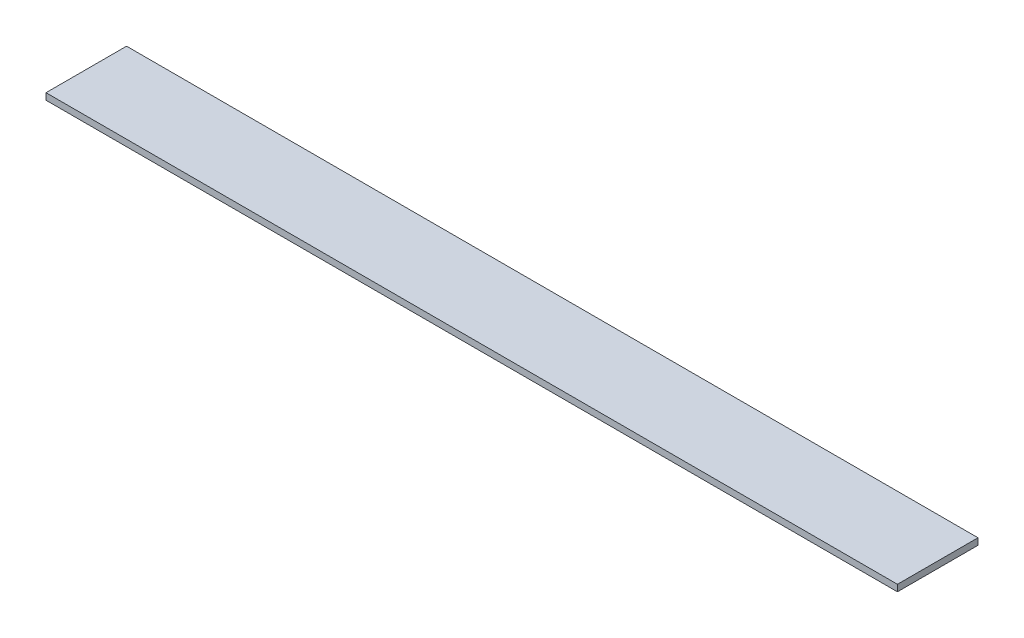
ISO-10303-21;
HEADER;
FILE_DESCRIPTION(('STEP AP214'),'2;1');
FILE_NAME('part.step','',(''),(''),'','','');
FILE_SCHEMA(('AUTOMOTIVE_DESIGN { 1 0 10303 214 1 1 1 1 }'));
ENDSEC;
DATA;
#1=APPLICATION_CONTEXT('core data for automotive mechanical design processes');
#2=APPLICATION_PROTOCOL_DEFINITION('international standard','automotive_design',2000,#1);
#3=PRODUCT_CONTEXT('',#1,'mechanical');
#4=PRODUCT('Part','Part','',(#3));
#5=PRODUCT_RELATED_PRODUCT_CATEGORY('part','',(#4));
#6=PRODUCT_DEFINITION_FORMATION('','',#4);
#7=PRODUCT_DEFINITION_CONTEXT('part definition',#1,'design');
#8=PRODUCT_DEFINITION('design','',#6,#7);
#9=PRODUCT_DEFINITION_SHAPE('','',#8);
#10=(LENGTH_UNIT() NAMED_UNIT(*) SI_UNIT(.MILLI.,.METRE.));
#11=(NAMED_UNIT(*) PLANE_ANGLE_UNIT() SI_UNIT($,.RADIAN.));
#12=(NAMED_UNIT(*) SI_UNIT($,.STERADIAN.) SOLID_ANGLE_UNIT());
#13=UNCERTAINTY_MEASURE_WITH_UNIT(LENGTH_MEASURE(1.E-05),#10,'distance_accuracy_value','');
#14=(GEOMETRIC_REPRESENTATION_CONTEXT(3) GLOBAL_UNCERTAINTY_ASSIGNED_CONTEXT((#13)) GLOBAL_UNIT_ASSIGNED_CONTEXT((#10,
#11,#12)) REPRESENTATION_CONTEXT('',''));
#15=CARTESIAN_POINT('',(0.,0.,0.));
#16=DIRECTION('',(0.,0.,1.));
#17=DIRECTION('',(1.,0.,0.));
#18=AXIS2_PLACEMENT_3D('',#15,#16,#17);
#19=CARTESIAN_POINT('',(0.,1.,0.));
#20=DIRECTION('',(1.,0.,0.));
#21=DIRECTION('',(0.,0.,-1.));
#22=AXIS2_PLACEMENT_3D('',#19,#20,#21);
#23=PLANE('',#22);
#24=DIRECTION('',(0.,0.,1.));
#25=VECTOR('',#24,1.);
#26=CARTESIAN_POINT('',(0.,0.,0.));
#27=LINE('',#26,#25);
#28=CARTESIAN_POINT('',(0.,0.,-12.3));
#29=VERTEX_POINT('',#28);
#30=CARTESIAN_POINT('',(0.,0.,0.));
#31=VERTEX_POINT('',#30);
#32=EDGE_CURVE('E95',#29,#31,#27,.T.);
#33=ORIENTED_EDGE('',*,*,#32,.T.);
#34=DIRECTION('',(0.,-1.,0.));
#35=VECTOR('',#34,1.);
#36=CARTESIAN_POINT('',(0.,1.,0.));
#37=LINE('',#36,#35);
#38=CARTESIAN_POINT('',(0.,1.,0.));
#39=VERTEX_POINT('',#38);
#40=EDGE_CURVE('E11',#39,#31,#37,.T.);
#41=ORIENTED_EDGE('',*,*,#40,.F.);
#42=DIRECTION('',(0.,0.,1.));
#43=VECTOR('',#42,1.);
#44=CARTESIAN_POINT('',(0.,1.,0.));
#45=LINE('',#44,#43);
#46=CARTESIAN_POINT('',(0.,1.,-12.3));
#47=VERTEX_POINT('',#46);
#48=EDGE_CURVE('E83',#47,#39,#45,.T.);
#49=ORIENTED_EDGE('',*,*,#48,.F.);
#50=DIRECTION('',(0.,-1.,0.));
#51=VECTOR('',#50,1.);
#52=CARTESIAN_POINT('',(0.,1.,-12.3));
#53=LINE('',#52,#51);
#54=EDGE_CURVE('E91',#47,#29,#53,.T.);
#55=ORIENTED_EDGE('',*,*,#54,.T.);
#56=EDGE_LOOP('',(#33,#41,#49,#55));
#57=FACE_BOUND('',#56,.T.);
#58=ADVANCED_FACE('F32',(#57),#23,.F.);
#59=CARTESIAN_POINT('',(0.,1.,0.));
#60=DIRECTION('',(0.,0.,-1.));
#61=DIRECTION('',(-1.,0.,0.));
#62=AXIS2_PLACEMENT_3D('',#59,#60,#61);
#63=PLANE('',#62);
#64=DIRECTION('',(1.,0.,0.));
#65=VECTOR('',#64,1.);
#66=CARTESIAN_POINT('',(0.,0.,0.));
#67=LINE('',#66,#65);
#68=CARTESIAN_POINT('',(130.,0.,0.));
#69=VERTEX_POINT('',#68);
#70=EDGE_CURVE('E87',#31,#69,#67,.T.);
#71=ORIENTED_EDGE('',*,*,#70,.T.);
#72=DIRECTION('',(0.,-1.,0.));
#73=VECTOR('',#72,1.);
#74=CARTESIAN_POINT('',(130.,1.,0.));
#75=LINE('',#74,#73);
#76=CARTESIAN_POINT('',(130.,1.,0.));
#77=VERTEX_POINT('',#76);
#78=EDGE_CURVE('E40',#77,#69,#75,.T.);
#79=ORIENTED_EDGE('',*,*,#78,.F.);
#80=DIRECTION('',(1.,0.,0.));
#81=VECTOR('',#80,1.);
#82=CARTESIAN_POINT('',(0.,1.,0.));
#83=LINE('',#82,#81);
#84=EDGE_CURVE('E78',#39,#77,#83,.T.);
#85=ORIENTED_EDGE('',*,*,#84,.F.);
#86=ORIENTED_EDGE('',*,*,#40,.T.);
#87=EDGE_LOOP('',(#71,#79,#85,#86));
#88=FACE_BOUND('',#87,.T.);
#89=ADVANCED_FACE('F86',(#88),#63,.F.);
#90=CARTESIAN_POINT('',(130.,1.,0.));
#91=DIRECTION('',(-1.,0.,0.));
#92=DIRECTION('',(0.,0.,1.));
#93=AXIS2_PLACEMENT_3D('',#90,#91,#92);
#94=PLANE('',#93);
#95=DIRECTION('',(0.,0.,-1.));
#96=VECTOR('',#95,1.);
#97=CARTESIAN_POINT('',(130.,0.,0.));
#98=LINE('',#97,#96);
#99=CARTESIAN_POINT('',(130.,0.,-12.3));
#100=VERTEX_POINT('',#99);
#101=EDGE_CURVE('E65',#69,#100,#98,.T.);
#102=ORIENTED_EDGE('',*,*,#101,.T.);
#103=DIRECTION('',(0.,-1.,0.));
#104=VECTOR('',#103,1.);
#105=CARTESIAN_POINT('',(130.,1.,-12.3));
#106=LINE('',#105,#104);
#107=CARTESIAN_POINT('',(130.,1.,-12.3));
#108=VERTEX_POINT('',#107);
#109=EDGE_CURVE('E88',#108,#100,#106,.T.);
#110=ORIENTED_EDGE('',*,*,#109,.F.);
#111=DIRECTION('',(0.,0.,-1.));
#112=VECTOR('',#111,1.);
#113=CARTESIAN_POINT('',(130.,1.,0.));
#114=LINE('',#113,#112);
#115=EDGE_CURVE('E81',#77,#108,#114,.T.);
#116=ORIENTED_EDGE('',*,*,#115,.F.);
#117=ORIENTED_EDGE('',*,*,#78,.T.);
#118=EDGE_LOOP('',(#102,#110,#116,#117));
#119=FACE_BOUND('',#118,.T.);
#120=ADVANCED_FACE('F89',(#119),#94,.F.);
#121=CARTESIAN_POINT('',(0.,1.,-12.3));
#122=DIRECTION('',(0.,0.,1.));
#123=DIRECTION('',(1.,0.,0.));
#124=AXIS2_PLACEMENT_3D('',#121,#122,#123);
#125=PLANE('',#124);
#126=DIRECTION('',(-1.,0.,0.));
#127=VECTOR('',#126,1.);
#128=CARTESIAN_POINT('',(0.,0.,-12.3));
#129=LINE('',#128,#127);
#130=EDGE_CURVE('E71',#100,#29,#129,.T.);
#131=ORIENTED_EDGE('',*,*,#130,.T.);
#132=ORIENTED_EDGE('',*,*,#54,.F.);
#133=DIRECTION('',(-1.,0.,0.));
#134=VECTOR('',#133,1.);
#135=CARTESIAN_POINT('',(0.,1.,-12.3));
#136=LINE('',#135,#134);
#137=EDGE_CURVE('E48',#108,#47,#136,.T.);
#138=ORIENTED_EDGE('',*,*,#137,.F.);
#139=ORIENTED_EDGE('',*,*,#109,.T.);
#140=EDGE_LOOP('',(#131,#132,#138,#139));
#141=FACE_BOUND('',#140,.T.);
#142=ADVANCED_FACE('F102',(#141),#125,.F.);
#143=CARTESIAN_POINT('',(0.,1.,0.));
#144=DIRECTION('',(0.,-1.,0.));
#145=DIRECTION('',(0.,0.,-1.));
#146=AXIS2_PLACEMENT_3D('',#143,#144,#145);
#147=PLANE('',#146);
#148=ORIENTED_EDGE('',*,*,#48,.T.);
#149=ORIENTED_EDGE('',*,*,#84,.T.);
#150=ORIENTED_EDGE('',*,*,#115,.T.);
#151=ORIENTED_EDGE('',*,*,#137,.T.);
#152=EDGE_LOOP('',(#148,#149,#150,#151));
#153=FACE_BOUND('',#152,.T.);
#154=ADVANCED_FACE('F79',(#153),#147,.F.);
#155=CARTESIAN_POINT('',(0.,0.,0.));
#156=DIRECTION('',(0.,-1.,0.));
#157=DIRECTION('',(0.,0.,-1.));
#158=AXIS2_PLACEMENT_3D('',#155,#156,#157);
#159=PLANE('',#158);
#160=ORIENTED_EDGE('',*,*,#32,.F.);
#161=ORIENTED_EDGE('',*,*,#130,.F.);
#162=ORIENTED_EDGE('',*,*,#101,.F.);
#163=ORIENTED_EDGE('',*,*,#70,.F.);
#164=EDGE_LOOP('',(#160,#161,#162,#163));
#165=FACE_BOUND('',#164,.T.);
#166=ADVANCED_FACE('F105',(#165),#159,.T.);
#167=CLOSED_SHELL('',(#58,#89,#120,#142,#154,#166));
#168=MANIFOLD_SOLID_BREP('B2',#167);
#169=ADVANCED_BREP_SHAPE_REPRESENTATION('',(#18,#168),#14);
#170=SHAPE_DEFINITION_REPRESENTATION(#9,#169);
ENDSEC;
END-ISO-10303-21;
